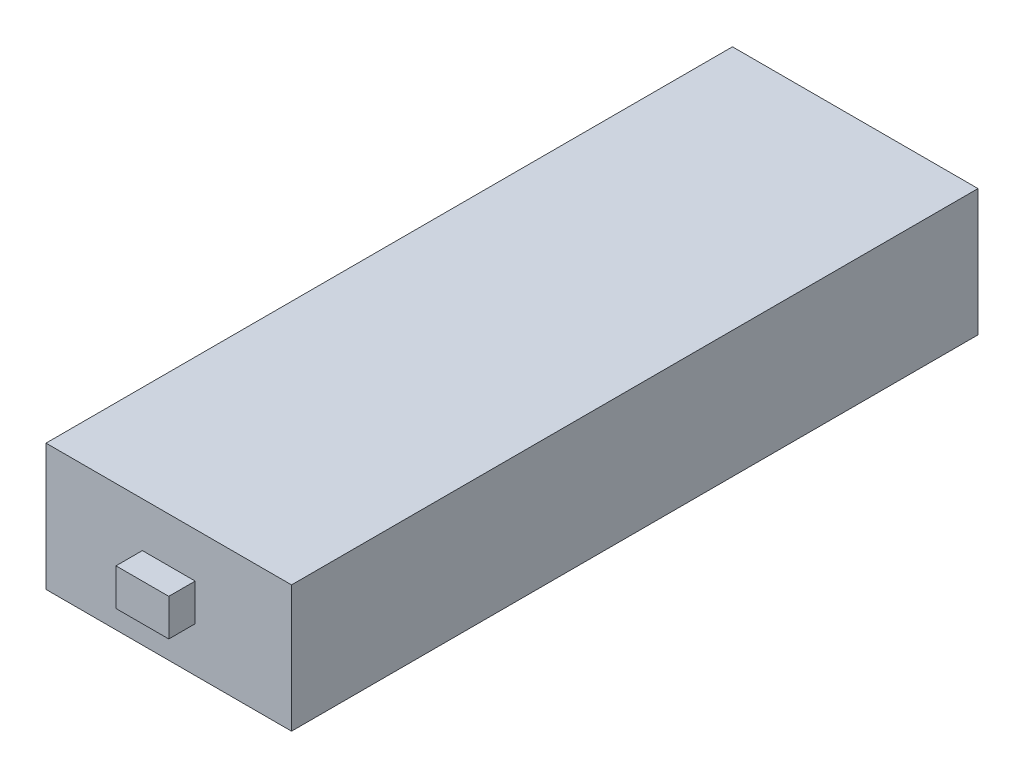
ISO-10303-21;
HEADER;
FILE_DESCRIPTION(('STEP AP214'),'2;1');
FILE_NAME('part.step','',(''),(''),'','','');
FILE_SCHEMA(('AUTOMOTIVE_DESIGN { 1 0 10303 214 1 1 1 1 }'));
ENDSEC;
DATA;
#1=APPLICATION_CONTEXT('core data for automotive mechanical design processes');
#2=APPLICATION_PROTOCOL_DEFINITION('international standard','automotive_design',2000,#1);
#3=PRODUCT_CONTEXT('',#1,'mechanical');
#4=PRODUCT('Part','Part','',(#3));
#5=PRODUCT_RELATED_PRODUCT_CATEGORY('part','',(#4));
#6=PRODUCT_DEFINITION_FORMATION('','',#4);
#7=PRODUCT_DEFINITION_CONTEXT('part definition',#1,'design');
#8=PRODUCT_DEFINITION('design','',#6,#7);
#9=PRODUCT_DEFINITION_SHAPE('','',#8);
#10=(LENGTH_UNIT() NAMED_UNIT(*) SI_UNIT(.MILLI.,.METRE.));
#11=(NAMED_UNIT(*) PLANE_ANGLE_UNIT() SI_UNIT($,.RADIAN.));
#12=(NAMED_UNIT(*) SI_UNIT($,.STERADIAN.) SOLID_ANGLE_UNIT());
#13=UNCERTAINTY_MEASURE_WITH_UNIT(LENGTH_MEASURE(1.E-05),#10,'distance_accuracy_value','');
#14=(GEOMETRIC_REPRESENTATION_CONTEXT(3) GLOBAL_UNCERTAINTY_ASSIGNED_CONTEXT((#13)) GLOBAL_UNIT_ASSIGNED_CONTEXT((#10,
#11,#12)) REPRESENTATION_CONTEXT('',''));
#15=CARTESIAN_POINT('',(0.,0.,0.));
#16=DIRECTION('',(0.,0.,1.));
#17=DIRECTION('',(1.,0.,0.));
#18=AXIS2_PLACEMENT_3D('',#15,#16,#17);
#19=CARTESIAN_POINT('',(23.25,24.,65.));
#20=DIRECTION('',(0.,0.,-1.));
#21=DIRECTION('',(-1.,0.,0.));
#22=AXIS2_PLACEMENT_3D('',#19,#20,#21);
#23=PLANE('',#22);
#24=DIRECTION('',(1.,0.,0.));
#25=VECTOR('',#24,1.);
#26=CARTESIAN_POINT('',(23.25,0.,65.));
#27=LINE('',#26,#25);
#28=CARTESIAN_POINT('',(-23.25,0.,65.));
#29=VERTEX_POINT('',#28);
#30=CARTESIAN_POINT('',(23.25,0.,65.));
#31=VERTEX_POINT('',#30);
#32=EDGE_CURVE('E133',#29,#31,#27,.T.);
#33=ORIENTED_EDGE('',*,*,#32,.T.);
#34=DIRECTION('',(0.,-1.,0.));
#35=VECTOR('',#34,1.);
#36=CARTESIAN_POINT('',(23.25,24.,65.));
#37=LINE('',#36,#35);
#38=CARTESIAN_POINT('',(23.25,24.,65.));
#39=VERTEX_POINT('',#38);
#40=EDGE_CURVE('E48',#39,#31,#37,.T.);
#41=ORIENTED_EDGE('',*,*,#40,.F.);
#42=DIRECTION('',(1.,0.,0.));
#43=VECTOR('',#42,1.);
#44=CARTESIAN_POINT('',(23.25,24.,65.));
#45=LINE('',#44,#43);
#46=CARTESIAN_POINT('',(-23.25,24.,65.));
#47=VERTEX_POINT('',#46);
#48=EDGE_CURVE('E143',#47,#39,#45,.T.);
#49=ORIENTED_EDGE('',*,*,#48,.F.);
#50=DIRECTION('',(0.,-1.,0.));
#51=VECTOR('',#50,1.);
#52=CARTESIAN_POINT('',(-23.25,24.,65.));
#53=LINE('',#52,#51);
#54=EDGE_CURVE('E11',#47,#29,#53,.T.);
#55=ORIENTED_EDGE('',*,*,#54,.T.);
#56=EDGE_LOOP('',(#33,#41,#49,#55));
#57=FACE_BOUND('',#56,.T.);
#58=DIRECTION('',(0.,-1.,0.));
#59=VECTOR('',#58,1.);
#60=CARTESIAN_POINT('',(-4.99999999999998,8.5,65.));
#61=LINE('',#60,#59);
#62=CARTESIAN_POINT('',(-4.99999999999998,15.5,65.));
#63=VERTEX_POINT('',#62);
#64=CARTESIAN_POINT('',(-4.99999999999998,8.5,65.));
#65=VERTEX_POINT('',#64);
#66=EDGE_CURVE('E55',#63,#65,#61,.T.);
#67=ORIENTED_EDGE('',*,*,#66,.F.);
#68=DIRECTION('',(-1.,0.,0.));
#69=VECTOR('',#68,1.);
#70=CARTESIAN_POINT('',(5.00000000000002,15.5,65.));
#71=LINE('',#70,#69);
#72=CARTESIAN_POINT('',(5.00000000000002,15.5,65.));
#73=VERTEX_POINT('',#72);
#74=EDGE_CURVE('E59',#73,#63,#71,.T.);
#75=ORIENTED_EDGE('',*,*,#74,.F.);
#76=DIRECTION('',(0.,1.,0.));
#77=VECTOR('',#76,1.);
#78=CARTESIAN_POINT('',(5.00000000000002,8.5,65.));
#79=LINE('',#78,#77);
#80=CARTESIAN_POINT('',(5.00000000000002,8.5,65.));
#81=VERTEX_POINT('',#80);
#82=EDGE_CURVE('E283',#81,#73,#79,.T.);
#83=ORIENTED_EDGE('',*,*,#82,.F.);
#84=DIRECTION('',(1.,0.,0.));
#85=VECTOR('',#84,1.);
#86=CARTESIAN_POINT('',(5.00000000000002,8.5,65.));
#87=LINE('',#86,#85);
#88=EDGE_CURVE('E293',#65,#81,#87,.T.);
#89=ORIENTED_EDGE('',*,*,#88,.F.);
#90=EDGE_LOOP('',(#67,#75,#83,#89));
#91=FACE_BOUND('',#90,.T.);
#92=ADVANCED_FACE('F39',(#57,#91),#23,.F.);
#93=CARTESIAN_POINT('',(-23.25,24.,65.));
#94=DIRECTION('',(1.,0.,0.));
#95=DIRECTION('',(0.,0.,-1.));
#96=AXIS2_PLACEMENT_3D('',#93,#94,#95);
#97=PLANE('',#96);
#98=DIRECTION('',(0.,0.,1.));
#99=VECTOR('',#98,1.);
#100=CARTESIAN_POINT('',(-23.25,0.,65.));
#101=LINE('',#100,#99);
#102=CARTESIAN_POINT('',(-23.25,0.,-65.));
#103=VERTEX_POINT('',#102);
#104=EDGE_CURVE('E128',#103,#29,#101,.T.);
#105=ORIENTED_EDGE('',*,*,#104,.T.);
#106=ORIENTED_EDGE('',*,*,#54,.F.);
#107=DIRECTION('',(0.,0.,1.));
#108=VECTOR('',#107,1.);
#109=CARTESIAN_POINT('',(-23.25,24.,65.));
#110=LINE('',#109,#108);
#111=CARTESIAN_POINT('',(-23.25,24.,-65.));
#112=VERTEX_POINT('',#111);
#113=EDGE_CURVE('E139',#112,#47,#110,.T.);
#114=ORIENTED_EDGE('',*,*,#113,.F.);
#115=DIRECTION('',(0.,-1.,0.));
#116=VECTOR('',#115,1.);
#117=CARTESIAN_POINT('',(-23.25,24.,-65.));
#118=LINE('',#117,#116);
#119=EDGE_CURVE('E152',#112,#103,#118,.T.);
#120=ORIENTED_EDGE('',*,*,#119,.T.);
#121=EDGE_LOOP('',(#105,#106,#114,#120));
#122=FACE_BOUND('',#121,.T.);
#123=ADVANCED_FACE('F41',(#122),#97,.F.);
#124=CARTESIAN_POINT('',(23.25,24.,65.));
#125=DIRECTION('',(-1.,0.,0.));
#126=DIRECTION('',(0.,0.,1.));
#127=AXIS2_PLACEMENT_3D('',#124,#125,#126);
#128=PLANE('',#127);
#129=DIRECTION('',(0.,0.,-1.));
#130=VECTOR('',#129,1.);
#131=CARTESIAN_POINT('',(23.25,0.,65.));
#132=LINE('',#131,#130);
#133=CARTESIAN_POINT('',(23.25,0.,-65.));
#134=VERTEX_POINT('',#133);
#135=EDGE_CURVE('E156',#31,#134,#132,.T.);
#136=ORIENTED_EDGE('',*,*,#135,.T.);
#137=DIRECTION('',(0.,-1.,0.));
#138=VECTOR('',#137,1.);
#139=CARTESIAN_POINT('',(23.25,24.,-65.));
#140=LINE('',#139,#138);
#141=CARTESIAN_POINT('',(23.25,24.,-65.));
#142=VERTEX_POINT('',#141);
#143=EDGE_CURVE('E164',#142,#134,#140,.T.);
#144=ORIENTED_EDGE('',*,*,#143,.F.);
#145=DIRECTION('',(0.,0.,-1.));
#146=VECTOR('',#145,1.);
#147=CARTESIAN_POINT('',(23.25,24.,65.));
#148=LINE('',#147,#146);
#149=EDGE_CURVE('E147',#39,#142,#148,.T.);
#150=ORIENTED_EDGE('',*,*,#149,.F.);
#151=ORIENTED_EDGE('',*,*,#40,.T.);
#152=EDGE_LOOP('',(#136,#144,#150,#151));
#153=FACE_BOUND('',#152,.T.);
#154=ADVANCED_FACE('F173',(#153),#128,.F.);
#155=CARTESIAN_POINT('',(23.25,24.,-65.));
#156=DIRECTION('',(0.,0.,1.));
#157=DIRECTION('',(1.,0.,0.));
#158=AXIS2_PLACEMENT_3D('',#155,#156,#157);
#159=PLANE('',#158);
#160=DIRECTION('',(-1.,0.,0.));
#161=VECTOR('',#160,1.);
#162=CARTESIAN_POINT('',(23.25,0.,-65.));
#163=LINE('',#162,#161);
#164=EDGE_CURVE('E144',#134,#103,#163,.T.);
#165=ORIENTED_EDGE('',*,*,#164,.T.);
#166=ORIENTED_EDGE('',*,*,#119,.F.);
#167=DIRECTION('',(-1.,0.,0.));
#168=VECTOR('',#167,1.);
#169=CARTESIAN_POINT('',(23.25,24.,-65.));
#170=LINE('',#169,#168);
#171=EDGE_CURVE('E150',#142,#112,#170,.T.);
#172=ORIENTED_EDGE('',*,*,#171,.F.);
#173=ORIENTED_EDGE('',*,*,#143,.T.);
#174=EDGE_LOOP('',(#165,#166,#172,#173));
#175=FACE_BOUND('',#174,.T.);
#176=ADVANCED_FACE('F182',(#175),#159,.F.);
#177=CARTESIAN_POINT('',(0.,24.,0.));
#178=DIRECTION('',(0.,1.,0.));
#179=DIRECTION('',(0.,0.,1.));
#180=AXIS2_PLACEMENT_3D('',#177,#178,#179);
#181=PLANE('',#180);
#182=ORIENTED_EDGE('',*,*,#113,.T.);
#183=ORIENTED_EDGE('',*,*,#48,.T.);
#184=ORIENTED_EDGE('',*,*,#149,.T.);
#185=ORIENTED_EDGE('',*,*,#171,.T.);
#186=EDGE_LOOP('',(#182,#183,#184,#185));
#187=FACE_BOUND('',#186,.T.);
#188=ADVANCED_FACE('F188',(#187),#181,.T.);
#189=CARTESIAN_POINT('',(0.,0.,0.));
#190=DIRECTION('',(0.,1.,0.));
#191=DIRECTION('',(0.,0.,1.));
#192=AXIS2_PLACEMENT_3D('',#189,#190,#191);
#193=PLANE('',#192);
#194=ORIENTED_EDGE('',*,*,#104,.F.);
#195=ORIENTED_EDGE('',*,*,#164,.F.);
#196=ORIENTED_EDGE('',*,*,#135,.F.);
#197=ORIENTED_EDGE('',*,*,#32,.F.);
#198=EDGE_LOOP('',(#194,#195,#196,#197));
#199=FACE_BOUND('',#198,.T.);
#200=ADVANCED_FACE('F179',(#199),#193,.F.);
#201=CARTESIAN_POINT('',(-4.99999999999998,8.5,70.));
#202=DIRECTION('',(1.,0.,0.));
#203=DIRECTION('',(0.,0.,-1.));
#204=AXIS2_PLACEMENT_3D('',#201,#202,#203);
#205=PLANE('',#204);
#206=ORIENTED_EDGE('',*,*,#66,.T.);
#207=DIRECTION('',(0.,0.,-1.));
#208=VECTOR('',#207,1.);
#209=CARTESIAN_POINT('',(-4.99999999999998,8.5,70.));
#210=LINE('',#209,#208);
#211=CARTESIAN_POINT('',(-4.99999999999998,8.5,70.));
#212=VERTEX_POINT('',#211);
#213=EDGE_CURVE('E108',#212,#65,#210,.T.);
#214=ORIENTED_EDGE('',*,*,#213,.F.);
#215=DIRECTION('',(0.,-1.,0.));
#216=VECTOR('',#215,1.);
#217=CARTESIAN_POINT('',(-4.99999999999998,8.5,70.));
#218=LINE('',#217,#216);
#219=CARTESIAN_POINT('',(-4.99999999999998,15.5,70.));
#220=VERTEX_POINT('',#219);
#221=EDGE_CURVE('E115',#220,#212,#218,.T.);
#222=ORIENTED_EDGE('',*,*,#221,.F.);
#223=DIRECTION('',(0.,0.,-1.));
#224=VECTOR('',#223,1.);
#225=CARTESIAN_POINT('',(-4.99999999999998,15.5,70.));
#226=LINE('',#225,#224);
#227=EDGE_CURVE('E280',#220,#63,#226,.T.);
#228=ORIENTED_EDGE('',*,*,#227,.T.);
#229=EDGE_LOOP('',(#206,#214,#222,#228));
#230=FACE_BOUND('',#229,.T.);
#231=ADVANCED_FACE('F126',(#230),#205,.F.);
#232=CARTESIAN_POINT('',(5.00000000000002,8.5,70.));
#233=DIRECTION('',(0.,1.,0.));
#234=DIRECTION('',(-1.,0.,0.));
#235=AXIS2_PLACEMENT_3D('',#232,#233,#234);
#236=PLANE('',#235);
#237=ORIENTED_EDGE('',*,*,#88,.T.);
#238=DIRECTION('',(0.,0.,-1.));
#239=VECTOR('',#238,1.);
#240=CARTESIAN_POINT('',(5.00000000000002,8.5,70.));
#241=LINE('',#240,#239);
#242=CARTESIAN_POINT('',(5.00000000000002,8.5,70.));
#243=VERTEX_POINT('',#242);
#244=EDGE_CURVE('E110',#243,#81,#241,.T.);
#245=ORIENTED_EDGE('',*,*,#244,.F.);
#246=DIRECTION('',(1.,0.,0.));
#247=VECTOR('',#246,1.);
#248=CARTESIAN_POINT('',(5.00000000000002,8.5,70.));
#249=LINE('',#248,#247);
#250=EDGE_CURVE('E103',#212,#243,#249,.T.);
#251=ORIENTED_EDGE('',*,*,#250,.F.);
#252=ORIENTED_EDGE('',*,*,#213,.T.);
#253=EDGE_LOOP('',(#237,#245,#251,#252));
#254=FACE_BOUND('',#253,.T.);
#255=ADVANCED_FACE('F106',(#254),#236,.F.);
#256=CARTESIAN_POINT('',(5.00000000000002,8.5,70.));
#257=DIRECTION('',(-1.,0.,0.));
#258=DIRECTION('',(0.,0.,1.));
#259=AXIS2_PLACEMENT_3D('',#256,#257,#258);
#260=PLANE('',#259);
#261=ORIENTED_EDGE('',*,*,#82,.T.);
#262=DIRECTION('',(0.,0.,-1.));
#263=VECTOR('',#262,1.);
#264=CARTESIAN_POINT('',(5.00000000000002,15.5,70.));
#265=LINE('',#264,#263);
#266=CARTESIAN_POINT('',(5.00000000000002,15.5,70.));
#267=VERTEX_POINT('',#266);
#268=EDGE_CURVE('E135',#267,#73,#265,.T.);
#269=ORIENTED_EDGE('',*,*,#268,.F.);
#270=DIRECTION('',(0.,1.,0.));
#271=VECTOR('',#270,1.);
#272=CARTESIAN_POINT('',(5.00000000000002,8.5,70.));
#273=LINE('',#272,#271);
#274=EDGE_CURVE('E114',#243,#267,#273,.T.);
#275=ORIENTED_EDGE('',*,*,#274,.F.);
#276=ORIENTED_EDGE('',*,*,#244,.T.);
#277=EDGE_LOOP('',(#261,#269,#275,#276));
#278=FACE_BOUND('',#277,.T.);
#279=ADVANCED_FACE('F206',(#278),#260,.F.);
#280=CARTESIAN_POINT('',(5.00000000000002,15.5,70.));
#281=DIRECTION('',(0.,-1.,0.));
#282=DIRECTION('',(1.,0.,0.));
#283=AXIS2_PLACEMENT_3D('',#280,#281,#282);
#284=PLANE('',#283);
#285=ORIENTED_EDGE('',*,*,#74,.T.);
#286=ORIENTED_EDGE('',*,*,#227,.F.);
#287=DIRECTION('',(-1.,0.,0.));
#288=VECTOR('',#287,1.);
#289=CARTESIAN_POINT('',(5.00000000000002,15.5,70.));
#290=LINE('',#289,#288);
#291=EDGE_CURVE('E120',#267,#220,#290,.T.);
#292=ORIENTED_EDGE('',*,*,#291,.F.);
#293=ORIENTED_EDGE('',*,*,#268,.T.);
#294=EDGE_LOOP('',(#285,#286,#292,#293));
#295=FACE_BOUND('',#294,.T.);
#296=ADVANCED_FACE('F209',(#295),#284,.F.);
#297=CARTESIAN_POINT('',(0.,0.,70.));
#298=DIRECTION('',(0.,0.,1.));
#299=DIRECTION('',(1.,0.,0.));
#300=AXIS2_PLACEMENT_3D('',#297,#298,#299);
#301=PLANE('',#300);
#302=ORIENTED_EDGE('',*,*,#221,.T.);
#303=ORIENTED_EDGE('',*,*,#250,.T.);
#304=ORIENTED_EDGE('',*,*,#274,.T.);
#305=ORIENTED_EDGE('',*,*,#291,.T.);
#306=EDGE_LOOP('',(#302,#303,#304,#305));
#307=FACE_BOUND('',#306,.T.);
#308=ADVANCED_FACE('F118',(#307),#301,.T.);
#309=CLOSED_SHELL('',(#92,#123,#154,#176,#188,#200,#231,#255,#279,#296,#308));
#310=MANIFOLD_SOLID_BREP('B2',#309);
#311=ADVANCED_BREP_SHAPE_REPRESENTATION('',(#18,#310),#14);
#312=SHAPE_DEFINITION_REPRESENTATION(#9,#311);
ENDSEC;
END-ISO-10303-21;
